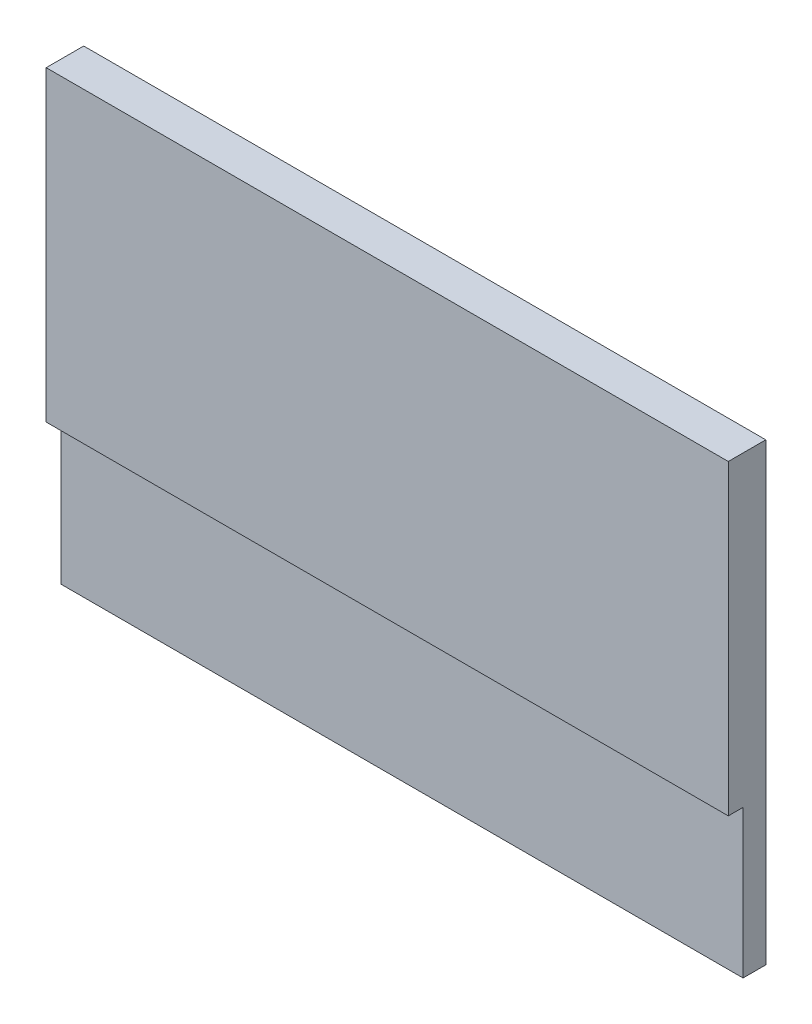
ISO-10303-21;
HEADER;
FILE_DESCRIPTION(('STEP AP214'),'2;1');
FILE_NAME('part.step','',(''),(''),'','','');
FILE_SCHEMA(('AUTOMOTIVE_DESIGN { 1 0 10303 214 1 1 1 1 }'));
ENDSEC;
DATA;
#1=APPLICATION_CONTEXT('core data for automotive mechanical design processes');
#2=APPLICATION_PROTOCOL_DEFINITION('international standard','automotive_design',2000,#1);
#3=PRODUCT_CONTEXT('',#1,'mechanical');
#4=PRODUCT('Part','Part','',(#3));
#5=PRODUCT_RELATED_PRODUCT_CATEGORY('part','',(#4));
#6=PRODUCT_DEFINITION_FORMATION('','',#4);
#7=PRODUCT_DEFINITION_CONTEXT('part definition',#1,'design');
#8=PRODUCT_DEFINITION('design','',#6,#7);
#9=PRODUCT_DEFINITION_SHAPE('','',#8);
#10=(LENGTH_UNIT() NAMED_UNIT(*) SI_UNIT(.MILLI.,.METRE.));
#11=(NAMED_UNIT(*) PLANE_ANGLE_UNIT() SI_UNIT($,.RADIAN.));
#12=(NAMED_UNIT(*) SI_UNIT($,.STERADIAN.) SOLID_ANGLE_UNIT());
#13=UNCERTAINTY_MEASURE_WITH_UNIT(LENGTH_MEASURE(1.E-05),#10,'distance_accuracy_value','');
#14=(GEOMETRIC_REPRESENTATION_CONTEXT(3) GLOBAL_UNCERTAINTY_ASSIGNED_CONTEXT((#13)) GLOBAL_UNIT_ASSIGNED_CONTEXT((#10,
#11,#12)) REPRESENTATION_CONTEXT('',''));
#15=CARTESIAN_POINT('',(0.,0.,0.));
#16=DIRECTION('',(0.,0.,1.));
#17=DIRECTION('',(1.,0.,0.));
#18=AXIS2_PLACEMENT_3D('',#15,#16,#17);
#19=CARTESIAN_POINT('',(0.,0.,1.65));
#20=DIRECTION('',(1.,0.,0.));
#21=DIRECTION('',(0.,0.,-1.));
#22=AXIS2_PLACEMENT_3D('',#19,#20,#21);
#23=PLANE('',#22);
#24=DIRECTION('',(0.,-1.,0.));
#25=VECTOR('',#24,1.);
#26=CARTESIAN_POINT('',(0.,0.,1.));
#27=LINE('',#26,#25);
#28=CARTESIAN_POINT('',(0.,6.5,1.));
#29=VERTEX_POINT('',#28);
#30=CARTESIAN_POINT('',(0.,0.,1.));
#31=VERTEX_POINT('',#30);
#32=EDGE_CURVE('E120',#29,#31,#27,.T.);
#33=ORIENTED_EDGE('',*,*,#32,.F.);
#34=DIRECTION('',(0.,0.,1.));
#35=VECTOR('',#34,1.);
#36=CARTESIAN_POINT('',(0.,6.5,1.));
#37=LINE('',#36,#35);
#38=CARTESIAN_POINT('',(0.,6.5,1.65));
#39=VERTEX_POINT('',#38);
#40=EDGE_CURVE('E97',#29,#39,#37,.T.);
#41=ORIENTED_EDGE('',*,*,#40,.T.);
#42=DIRECTION('',(0.,-1.,0.));
#43=VECTOR('',#42,1.);
#44=CARTESIAN_POINT('',(0.,0.,1.65));
#45=LINE('',#44,#43);
#46=CARTESIAN_POINT('',(0.,20.,1.65));
#47=VERTEX_POINT('',#46);
#48=EDGE_CURVE('E83',#47,#39,#45,.T.);
#49=ORIENTED_EDGE('',*,*,#48,.F.);
#50=DIRECTION('',(0.,0.,-1.));
#51=VECTOR('',#50,1.);
#52=CARTESIAN_POINT('',(0.,20.,1.65));
#53=LINE('',#52,#51);
#54=CARTESIAN_POINT('',(0.,20.,0.));
#55=VERTEX_POINT('',#54);
#56=EDGE_CURVE('E76',#47,#55,#53,.T.);
#57=ORIENTED_EDGE('',*,*,#56,.T.);
#58=DIRECTION('',(0.,-1.,0.));
#59=VECTOR('',#58,1.);
#60=CARTESIAN_POINT('',(0.,0.,0.));
#61=LINE('',#60,#59);
#62=CARTESIAN_POINT('',(0.,0.,0.));
#63=VERTEX_POINT('',#62);
#64=EDGE_CURVE('E90',#55,#63,#61,.T.);
#65=ORIENTED_EDGE('',*,*,#64,.T.);
#66=DIRECTION('',(0.,0.,-1.));
#67=VECTOR('',#66,1.);
#68=CARTESIAN_POINT('',(0.,0.,1.65));
#69=LINE('',#68,#67);
#70=EDGE_CURVE('E11',#31,#63,#69,.T.);
#71=ORIENTED_EDGE('',*,*,#70,.F.);
#72=EDGE_LOOP('',(#33,#41,#49,#57,#65,#71));
#73=FACE_BOUND('',#72,.T.);
#74=ADVANCED_FACE('F32',(#73),#23,.F.);
#75=CARTESIAN_POINT('',(0.,0.,1.65));
#76=DIRECTION('',(0.,1.,0.));
#77=DIRECTION('',(0.,0.,1.));
#78=AXIS2_PLACEMENT_3D('',#75,#76,#77);
#79=PLANE('',#78);
#80=DIRECTION('',(0.,0.,-1.));
#81=VECTOR('',#80,1.);
#82=CARTESIAN_POINT('',(30.,0.,1.65));
#83=LINE('',#82,#81);
#84=CARTESIAN_POINT('',(30.,0.,1.));
#85=VERTEX_POINT('',#84);
#86=CARTESIAN_POINT('',(30.,0.,0.));
#87=VERTEX_POINT('',#86);
#88=EDGE_CURVE('E39',#85,#87,#83,.T.);
#89=ORIENTED_EDGE('',*,*,#88,.F.);
#90=DIRECTION('',(1.,0.,0.));
#91=VECTOR('',#90,1.);
#92=CARTESIAN_POINT('',(0.,0.,1.));
#93=LINE('',#92,#91);
#94=EDGE_CURVE('E118',#31,#85,#93,.T.);
#95=ORIENTED_EDGE('',*,*,#94,.F.);
#96=ORIENTED_EDGE('',*,*,#70,.T.);
#97=DIRECTION('',(1.,0.,0.));
#98=VECTOR('',#97,1.);
#99=CARTESIAN_POINT('',(0.,0.,0.));
#100=LINE('',#99,#98);
#101=EDGE_CURVE('E96',#63,#87,#100,.T.);
#102=ORIENTED_EDGE('',*,*,#101,.T.);
#103=EDGE_LOOP('',(#89,#95,#96,#102));
#104=FACE_BOUND('',#103,.T.);
#105=ADVANCED_FACE('F115',(#104),#79,.F.);
#106=CARTESIAN_POINT('',(30.,0.,1.65));
#107=DIRECTION('',(-1.,0.,0.));
#108=DIRECTION('',(0.,0.,1.));
#109=AXIS2_PLACEMENT_3D('',#106,#107,#108);
#110=PLANE('',#109);
#111=DIRECTION('',(0.,1.,0.));
#112=VECTOR('',#111,1.);
#113=CARTESIAN_POINT('',(30.,0.,1.65));
#114=LINE('',#113,#112);
#115=CARTESIAN_POINT('',(30.,6.5,1.65));
#116=VERTEX_POINT('',#115);
#117=CARTESIAN_POINT('',(30.,20.,1.65));
#118=VERTEX_POINT('',#117);
#119=EDGE_CURVE('E140',#116,#118,#114,.T.);
#120=ORIENTED_EDGE('',*,*,#119,.F.);
#121=DIRECTION('',(0.,0.,1.));
#122=VECTOR('',#121,1.);
#123=CARTESIAN_POINT('',(30.,6.5,1.));
#124=LINE('',#123,#122);
#125=CARTESIAN_POINT('',(30.,6.5,1.));
#126=VERTEX_POINT('',#125);
#127=EDGE_CURVE('E46',#126,#116,#124,.T.);
#128=ORIENTED_EDGE('',*,*,#127,.F.);
#129=DIRECTION('',(0.,1.,0.));
#130=VECTOR('',#129,1.);
#131=CARTESIAN_POINT('',(30.,0.,1.));
#132=LINE('',#131,#130);
#133=EDGE_CURVE('E112',#85,#126,#132,.T.);
#134=ORIENTED_EDGE('',*,*,#133,.F.);
#135=ORIENTED_EDGE('',*,*,#88,.T.);
#136=DIRECTION('',(0.,1.,0.));
#137=VECTOR('',#136,1.);
#138=CARTESIAN_POINT('',(30.,0.,0.));
#139=LINE('',#138,#137);
#140=CARTESIAN_POINT('',(30.,20.,0.));
#141=VERTEX_POINT('',#140);
#142=EDGE_CURVE('E84',#87,#141,#139,.T.);
#143=ORIENTED_EDGE('',*,*,#142,.T.);
#144=DIRECTION('',(0.,0.,-1.));
#145=VECTOR('',#144,1.);
#146=CARTESIAN_POINT('',(30.,20.,1.65));
#147=LINE('',#146,#145);
#148=EDGE_CURVE('E79',#118,#141,#147,.T.);
#149=ORIENTED_EDGE('',*,*,#148,.F.);
#150=EDGE_LOOP('',(#120,#128,#134,#135,#143,#149));
#151=FACE_BOUND('',#150,.T.);
#152=ADVANCED_FACE('F109',(#151),#110,.F.);
#153=CARTESIAN_POINT('',(0.,20.,1.65));
#154=DIRECTION('',(0.,-1.,0.));
#155=DIRECTION('',(0.,0.,-1.));
#156=AXIS2_PLACEMENT_3D('',#153,#154,#155);
#157=PLANE('',#156);
#158=DIRECTION('',(-1.,0.,0.));
#159=VECTOR('',#158,1.);
#160=CARTESIAN_POINT('',(0.,20.,0.));
#161=LINE('',#160,#159);
#162=EDGE_CURVE('E73',#141,#55,#161,.T.);
#163=ORIENTED_EDGE('',*,*,#162,.T.);
#164=ORIENTED_EDGE('',*,*,#56,.F.);
#165=DIRECTION('',(-1.,0.,0.));
#166=VECTOR('',#165,1.);
#167=CARTESIAN_POINT('',(0.,20.,1.65));
#168=LINE('',#167,#166);
#169=EDGE_CURVE('E55',#118,#47,#168,.T.);
#170=ORIENTED_EDGE('',*,*,#169,.F.);
#171=ORIENTED_EDGE('',*,*,#148,.T.);
#172=EDGE_LOOP('',(#163,#164,#170,#171));
#173=FACE_BOUND('',#172,.T.);
#174=ADVANCED_FACE('F75',(#173),#157,.F.);
#175=CARTESIAN_POINT('',(0.,0.,1.65));
#176=DIRECTION('',(0.,0.,-1.));
#177=DIRECTION('',(-1.,0.,0.));
#178=AXIS2_PLACEMENT_3D('',#175,#176,#177);
#179=PLANE('',#178);
#180=ORIENTED_EDGE('',*,*,#48,.T.);
#181=DIRECTION('',(-1.,0.,0.));
#182=VECTOR('',#181,1.);
#183=CARTESIAN_POINT('',(0.,6.5,1.65));
#184=LINE('',#183,#182);
#185=EDGE_CURVE('E132',#116,#39,#184,.T.);
#186=ORIENTED_EDGE('',*,*,#185,.F.);
#187=ORIENTED_EDGE('',*,*,#119,.T.);
#188=ORIENTED_EDGE('',*,*,#169,.T.);
#189=EDGE_LOOP('',(#180,#186,#187,#188));
#190=FACE_BOUND('',#189,.T.);
#191=ADVANCED_FACE('F141',(#190),#179,.F.);
#192=CARTESIAN_POINT('',(0.,0.,0.));
#193=DIRECTION('',(0.,0.,-1.));
#194=DIRECTION('',(-1.,0.,0.));
#195=AXIS2_PLACEMENT_3D('',#192,#193,#194);
#196=PLANE('',#195);
#197=ORIENTED_EDGE('',*,*,#64,.F.);
#198=ORIENTED_EDGE('',*,*,#162,.F.);
#199=ORIENTED_EDGE('',*,*,#142,.F.);
#200=ORIENTED_EDGE('',*,*,#101,.F.);
#201=EDGE_LOOP('',(#197,#198,#199,#200));
#202=FACE_BOUND('',#201,.T.);
#203=ADVANCED_FACE('F94',(#202),#196,.T.);
#204=CARTESIAN_POINT('',(0.,6.5,1.));
#205=DIRECTION('',(0.,1.,0.));
#206=DIRECTION('',(0.,0.,1.));
#207=AXIS2_PLACEMENT_3D('',#204,#205,#206);
#208=PLANE('',#207);
#209=ORIENTED_EDGE('',*,*,#185,.T.);
#210=ORIENTED_EDGE('',*,*,#40,.F.);
#211=DIRECTION('',(-1.,0.,0.));
#212=VECTOR('',#211,1.);
#213=CARTESIAN_POINT('',(0.,6.5,1.));
#214=LINE('',#213,#212);
#215=EDGE_CURVE('E131',#126,#29,#214,.T.);
#216=ORIENTED_EDGE('',*,*,#215,.F.);
#217=ORIENTED_EDGE('',*,*,#127,.T.);
#218=EDGE_LOOP('',(#209,#210,#216,#217));
#219=FACE_BOUND('',#218,.T.);
#220=ADVANCED_FACE('F130',(#219),#208,.F.);
#221=CARTESIAN_POINT('',(0.,0.,1.));
#222=DIRECTION('',(0.,0.,-1.));
#223=DIRECTION('',(-1.,0.,0.));
#224=AXIS2_PLACEMENT_3D('',#221,#222,#223);
#225=PLANE('',#224);
#226=ORIENTED_EDGE('',*,*,#32,.T.);
#227=ORIENTED_EDGE('',*,*,#94,.T.);
#228=ORIENTED_EDGE('',*,*,#133,.T.);
#229=ORIENTED_EDGE('',*,*,#215,.T.);
#230=EDGE_LOOP('',(#226,#227,#228,#229));
#231=FACE_BOUND('',#230,.T.);
#232=ADVANCED_FACE('F133',(#231),#225,.F.);
#233=CLOSED_SHELL('',(#74,#105,#152,#174,#191,#203,#220,#232));
#234=MANIFOLD_SOLID_BREP('B2',#233);
#235=ADVANCED_BREP_SHAPE_REPRESENTATION('',(#18,#234),#14);
#236=SHAPE_DEFINITION_REPRESENTATION(#9,#235);
ENDSEC;
END-ISO-10303-21;
